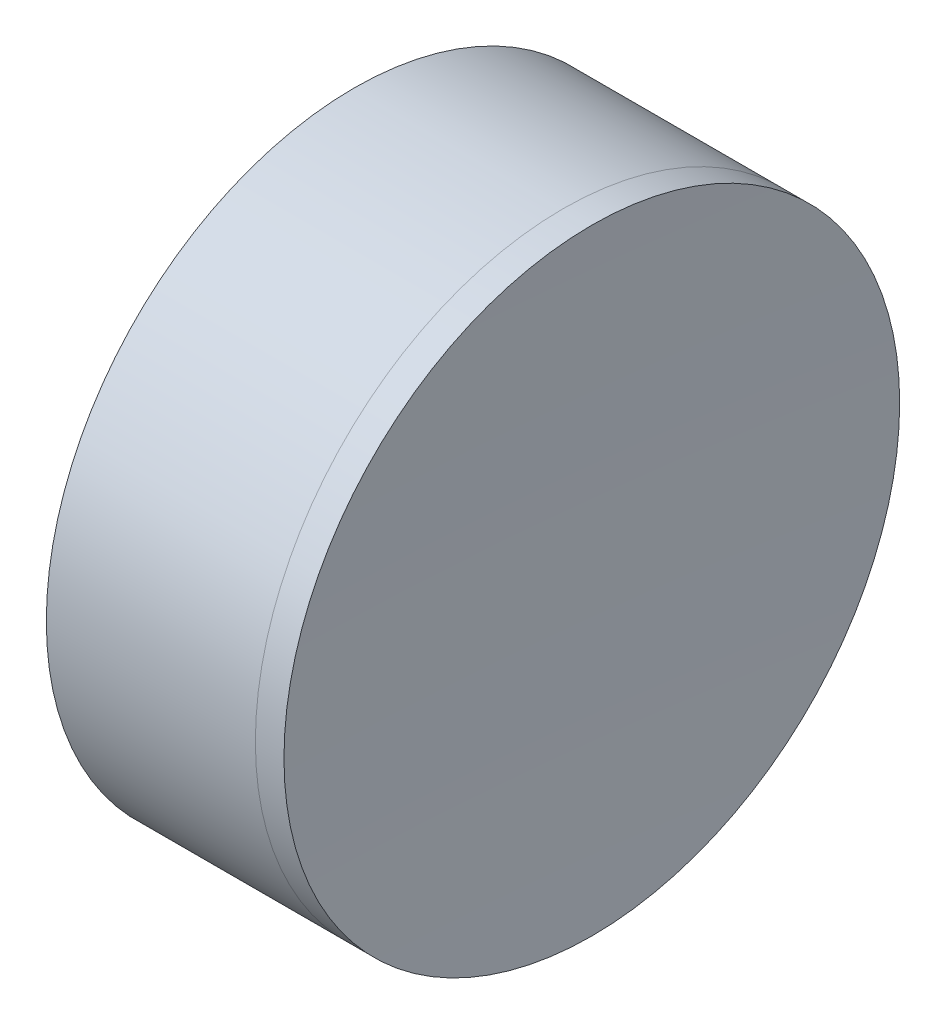
ISO-10303-21;
HEADER;
FILE_DESCRIPTION(('STEP AP214'),'2;1');
FILE_NAME('part.step','',(''),(''),'','','');
FILE_SCHEMA(('AUTOMOTIVE_DESIGN { 1 0 10303 214 1 1 1 1 }'));
ENDSEC;
DATA;
#1=APPLICATION_CONTEXT('core data for automotive mechanical design processes');
#2=APPLICATION_PROTOCOL_DEFINITION('international standard','automotive_design',2000,#1);
#3=PRODUCT_CONTEXT('',#1,'mechanical');
#4=PRODUCT('Part','Part','',(#3));
#5=PRODUCT_RELATED_PRODUCT_CATEGORY('part','',(#4));
#6=PRODUCT_DEFINITION_FORMATION('','',#4);
#7=PRODUCT_DEFINITION_CONTEXT('part definition',#1,'design');
#8=PRODUCT_DEFINITION('design','',#6,#7);
#9=PRODUCT_DEFINITION_SHAPE('','',#8);
#10=(LENGTH_UNIT() NAMED_UNIT(*) SI_UNIT(.MILLI.,.METRE.));
#11=(NAMED_UNIT(*) PLANE_ANGLE_UNIT() SI_UNIT($,.RADIAN.));
#12=(NAMED_UNIT(*) SI_UNIT($,.STERADIAN.) SOLID_ANGLE_UNIT());
#13=UNCERTAINTY_MEASURE_WITH_UNIT(LENGTH_MEASURE(1.E-05),#10,'distance_accuracy_value','');
#14=(GEOMETRIC_REPRESENTATION_CONTEXT(3) GLOBAL_UNCERTAINTY_ASSIGNED_CONTEXT((#13)) GLOBAL_UNIT_ASSIGNED_CONTEXT((#10,
#11,#12)) REPRESENTATION_CONTEXT('',''));
#15=CARTESIAN_POINT('',(0.,0.,0.));
#16=DIRECTION('',(0.,0.,1.));
#17=DIRECTION('',(1.,0.,0.));
#18=AXIS2_PLACEMENT_3D('',#15,#16,#17);
#19=CARTESIAN_POINT('',(186.338791314652,0.,0.));
#20=DIRECTION('',(-1.,0.,0.));
#21=DIRECTION('',(0.,0.,1.));
#22=AXIS2_PLACEMENT_3D('',#19,#20,#21);
#23=SPHERICAL_SURFACE('',#22,27.86);
#24=CARTESIAN_POINT('',(161.541823758114,0.,0.));
#25=DIRECTION('',(-1.,0.,0.));
#26=DIRECTION('',(0.,0.,1.));
#27=AXIS2_PLACEMENT_3D('',#24,#25,#26);
#28=CIRCLE('',#27,12.6999999999999);
#29=CARTESIAN_POINT('',(161.541823758114,0.,12.6999999999999));
#30=VERTEX_POINT('',#29);
#31=EDGE_CURVE('E11',#30,#30,#28,.T.);
#32=ORIENTED_EDGE('',*,*,#31,.T.);
#33=EDGE_LOOP('',(#32));
#34=FACE_BOUND('',#33,.T.);
#35=ADVANCED_FACE('F45',(#34),#23,.T.);
#36=CARTESIAN_POINT('',(152.918264235644,0.,0.));
#37=DIRECTION('',(-1.,0.,0.));
#38=DIRECTION('',(0.,0.,1.));
#39=AXIS2_PLACEMENT_3D('',#36,#37,#38);
#40=CYLINDRICAL_SURFACE('',#39,12.6999999999999);
#41=CARTESIAN_POINT('',(162.721567330593,0.,0.));
#42=DIRECTION('',(-1.,0.,0.));
#43=DIRECTION('',(0.,0.,1.));
#44=AXIS2_PLACEMENT_3D('',#41,#42,#43);
#45=CIRCLE('',#44,12.6999999999999);
#46=CARTESIAN_POINT('',(162.721567330593,0.,12.6999999999999));
#47=VERTEX_POINT('',#46);
#48=EDGE_CURVE('E51',#47,#47,#45,.T.);
#49=ORIENTED_EDGE('',*,*,#48,.T.);
#50=EDGE_LOOP('',(#49));
#51=FACE_BOUND('',#50,.T.);
#52=ORIENTED_EDGE('',*,*,#31,.F.);
#53=EDGE_LOOP('',(#52));
#54=FACE_BOUND('',#53,.T.);
#55=ADVANCED_FACE('F57',(#51,#54),#40,.T.);
#56=CARTESIAN_POINT('',(494.778791314652,0.,0.));
#57=DIRECTION('',(-1.,0.,0.));
#58=DIRECTION('',(0.,0.,-1.));
#59=AXIS2_PLACEMENT_3D('',#56,#57,#58);
#60=SPHERICAL_SURFACE('',#59,332.3);
#61=ORIENTED_EDGE('',*,*,#48,.F.);
#62=EDGE_LOOP('',(#61));
#63=FACE_BOUND('',#62,.T.);
#64=ADVANCED_FACE('F60',(#63),#60,.F.);
#65=CLOSED_SHELL('',(#35,#55,#64));
#66=MANIFOLD_SOLID_BREP('B2',#65);
#67=CARTESIAN_POINT('',(132.048791314652,0.,0.));
#68=DIRECTION('',(-1.,0.,0.));
#69=DIRECTION('',(0.,0.,1.));
#70=AXIS2_PLACEMENT_3D('',#67,#68,#69);
#71=SPHERICAL_SURFACE('',#70,24.43);
#72=CARTESIAN_POINT('',(152.918264235644,0.,0.));
#73=DIRECTION('',(-1.,0.,0.));
#74=DIRECTION('',(0.,0.,1.));
#75=AXIS2_PLACEMENT_3D('',#72,#73,#74);
#76=CIRCLE('',#75,12.7);
#77=CARTESIAN_POINT('',(152.918264235644,0.,12.6999999999999));
#78=VERTEX_POINT('',#77);
#79=EDGE_CURVE('E44',#78,#78,#76,.T.);
#80=ORIENTED_EDGE('',*,*,#79,.T.);
#81=EDGE_LOOP('',(#80));
#82=FACE_BOUND('',#81,.T.);
#83=ADVANCED_FACE('F86',(#82),#71,.F.);
#84=CARTESIAN_POINT('',(-185.274474050658,0.,0.));
#85=DIRECTION('',(-1.,0.,0.));
#86=DIRECTION('',(0.,0.,1.));
#87=AXIS2_PLACEMENT_3D('',#84,#85,#86);
#88=CYLINDRICAL_SURFACE('',#87,12.7);
#89=CARTESIAN_POINT('',(161.541823758114,0.,0.));
#90=DIRECTION('',(-1.,0.,0.));
#91=DIRECTION('',(0.,0.,1.));
#92=AXIS2_PLACEMENT_3D('',#89,#90,#91);
#93=CIRCLE('',#92,12.7);
#94=CARTESIAN_POINT('',(161.541823758114,0.,12.6999999999999));
#95=VERTEX_POINT('',#94);
#96=EDGE_CURVE('E92',#95,#95,#93,.T.);
#97=ORIENTED_EDGE('',*,*,#96,.T.);
#98=EDGE_LOOP('',(#97));
#99=FACE_BOUND('',#98,.T.);
#100=ORIENTED_EDGE('',*,*,#79,.F.);
#101=EDGE_LOOP('',(#100));
#102=FACE_BOUND('',#101,.T.);
#103=ADVANCED_FACE('F98',(#99,#102),#88,.T.);
#104=CARTESIAN_POINT('',(186.338791314652,0.,0.));
#105=DIRECTION('',(-1.,0.,0.));
#106=DIRECTION('',(0.,0.,1.));
#107=AXIS2_PLACEMENT_3D('',#104,#105,#106);
#108=SPHERICAL_SURFACE('',#107,27.86);
#109=ORIENTED_EDGE('',*,*,#96,.F.);
#110=EDGE_LOOP('',(#109));
#111=FACE_BOUND('',#110,.T.);
#112=ADVANCED_FACE('F101',(#111),#108,.F.);
#113=CLOSED_SHELL('',(#83,#103,#112));
#114=MANIFOLD_SOLID_BREP('B6',#113);
#115=ADVANCED_BREP_SHAPE_REPRESENTATION('',(#18,#66,#114),#14);
#116=SHAPE_DEFINITION_REPRESENTATION(#9,#115);
ENDSEC;
END-ISO-10303-21;
